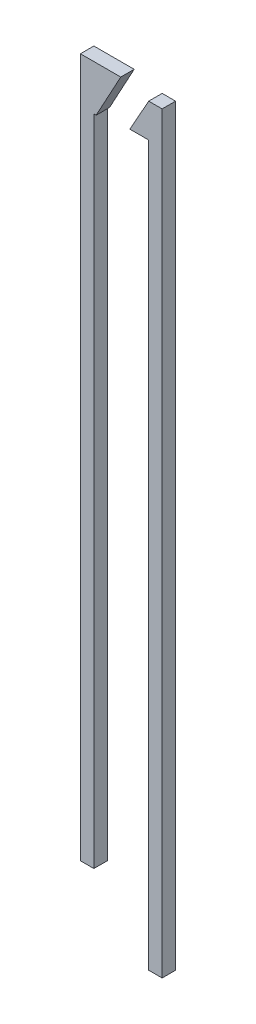
ISO-10303-21;
HEADER;
FILE_DESCRIPTION(('STEP AP214'),'2;1');
FILE_NAME('part.step','',(''),(''),'','','');
FILE_SCHEMA(('AUTOMOTIVE_DESIGN { 1 0 10303 214 1 1 1 1 }'));
ENDSEC;
DATA;
#1=APPLICATION_CONTEXT('core data for automotive mechanical design processes');
#2=APPLICATION_PROTOCOL_DEFINITION('international standard','automotive_design',2000,#1);
#3=PRODUCT_CONTEXT('',#1,'mechanical');
#4=PRODUCT('Part','Part','',(#3));
#5=PRODUCT_RELATED_PRODUCT_CATEGORY('part','',(#4));
#6=PRODUCT_DEFINITION_FORMATION('','',#4);
#7=PRODUCT_DEFINITION_CONTEXT('part definition',#1,'design');
#8=PRODUCT_DEFINITION('design','',#6,#7);
#9=PRODUCT_DEFINITION_SHAPE('','',#8);
#10=(LENGTH_UNIT() NAMED_UNIT(*) SI_UNIT(.MILLI.,.METRE.));
#11=(NAMED_UNIT(*) PLANE_ANGLE_UNIT() SI_UNIT($,.RADIAN.));
#12=(NAMED_UNIT(*) SI_UNIT($,.STERADIAN.) SOLID_ANGLE_UNIT());
#13=UNCERTAINTY_MEASURE_WITH_UNIT(LENGTH_MEASURE(1.E-05),#10,'distance_accuracy_value','');
#14=(GEOMETRIC_REPRESENTATION_CONTEXT(3) GLOBAL_UNCERTAINTY_ASSIGNED_CONTEXT((#13)) GLOBAL_UNIT_ASSIGNED_CONTEXT((#10,
#11,#12)) REPRESENTATION_CONTEXT('',''));
#15=CARTESIAN_POINT('',(0.,0.,0.));
#16=DIRECTION('',(0.,0.,1.));
#17=DIRECTION('',(1.,0.,0.));
#18=AXIS2_PLACEMENT_3D('',#15,#16,#17);
#19=CARTESIAN_POINT('',(-0.148264138017879,13.0387086582279,0.5));
#20=DIRECTION('',(1.,0.,0.));
#21=DIRECTION('',(0.,1.,0.));
#22=AXIS2_PLACEMENT_3D('',#19,#20,#21);
#23=PLANE('',#22);
#24=DIRECTION('',(0.,-1.,0.));
#25=VECTOR('',#24,1.);
#26=CARTESIAN_POINT('',(-0.148264138017879,13.0387086582279,0.));
#27=LINE('',#26,#25);
#28=CARTESIAN_POINT('',(-0.148264138017879,13.0387086582279,0.));
#29=VERTEX_POINT('',#28);
#30=CARTESIAN_POINT('',(-0.148264138017876,-12.9612913417721,0.));
#31=VERTEX_POINT('',#30);
#32=EDGE_CURVE('E127',#29,#31,#27,.T.);
#33=ORIENTED_EDGE('',*,*,#32,.T.);
#34=DIRECTION('',(0.,0.,-1.));
#35=VECTOR('',#34,1.);
#36=CARTESIAN_POINT('',(-0.148264138017876,-12.9612913417721,0.5));
#37=LINE('',#36,#35);
#38=CARTESIAN_POINT('',(-0.148264138017876,-12.9612913417721,0.5));
#39=VERTEX_POINT('',#38);
#40=EDGE_CURVE('E12',#39,#31,#37,.T.);
#41=ORIENTED_EDGE('',*,*,#40,.F.);
#42=DIRECTION('',(0.,-1.,0.));
#43=VECTOR('',#42,1.);
#44=CARTESIAN_POINT('',(-0.148264138017879,13.0387086582279,0.5));
#45=LINE('',#44,#43);
#46=CARTESIAN_POINT('',(-0.148264138017879,13.0387086582279,0.5));
#47=VERTEX_POINT('',#46);
#48=EDGE_CURVE('E137',#47,#39,#45,.T.);
#49=ORIENTED_EDGE('',*,*,#48,.F.);
#50=DIRECTION('',(0.,0.,-1.));
#51=VECTOR('',#50,1.);
#52=CARTESIAN_POINT('',(-0.148264138017879,13.0387086582279,0.5));
#53=LINE('',#52,#51);
#54=EDGE_CURVE('E123',#47,#29,#53,.T.);
#55=ORIENTED_EDGE('',*,*,#54,.T.);
#56=EDGE_LOOP('',(#33,#41,#49,#55));
#57=FACE_BOUND('',#56,.T.);
#58=ADVANCED_FACE('F43',(#57),#23,.F.);
#59=CARTESIAN_POINT('',(-0.148264138017876,-12.9612913417721,0.5));
#60=DIRECTION('',(0.,1.,0.));
#61=DIRECTION('',(0.,0.,1.));
#62=AXIS2_PLACEMENT_3D('',#59,#60,#61);
#63=PLANE('',#62);
#64=DIRECTION('',(1.,0.,0.));
#65=VECTOR('',#64,1.);
#66=CARTESIAN_POINT('',(-0.148264138017876,-12.9612913417721,0.));
#67=LINE('',#66,#65);
#68=CARTESIAN_POINT('',(0.351735861982124,-12.9612913417721,0.));
#69=VERTEX_POINT('',#68);
#70=EDGE_CURVE('E130',#31,#69,#67,.T.);
#71=ORIENTED_EDGE('',*,*,#70,.T.);
#72=DIRECTION('',(0.,0.,-1.));
#73=VECTOR('',#72,1.);
#74=CARTESIAN_POINT('',(0.351735861982124,-12.9612913417721,0.5));
#75=LINE('',#74,#73);
#76=CARTESIAN_POINT('',(0.351735861982124,-12.9612913417721,0.5));
#77=VERTEX_POINT('',#76);
#78=EDGE_CURVE('E51',#77,#69,#75,.T.);
#79=ORIENTED_EDGE('',*,*,#78,.F.);
#80=DIRECTION('',(1.,0.,0.));
#81=VECTOR('',#80,1.);
#82=CARTESIAN_POINT('',(-0.148264138017876,-12.9612913417721,0.5));
#83=LINE('',#82,#81);
#84=EDGE_CURVE('E96',#39,#77,#83,.T.);
#85=ORIENTED_EDGE('',*,*,#84,.F.);
#86=ORIENTED_EDGE('',*,*,#40,.T.);
#87=EDGE_LOOP('',(#71,#79,#85,#86));
#88=FACE_BOUND('',#87,.T.);
#89=ADVANCED_FACE('F161',(#88),#63,.F.);
#90=CARTESIAN_POINT('',(0.351735861982124,-12.9612913417721,0.5));
#91=DIRECTION('',(-1.,0.,0.));
#92=DIRECTION('',(0.,0.,1.));
#93=AXIS2_PLACEMENT_3D('',#90,#91,#92);
#94=PLANE('',#93);
#95=DIRECTION('',(0.,1.,0.));
#96=VECTOR('',#95,1.);
#97=CARTESIAN_POINT('',(0.351735861982124,-12.9612913417721,0.));
#98=LINE('',#97,#96);
#99=CARTESIAN_POINT('',(0.351735861982124,11.35,0.));
#100=VERTEX_POINT('',#99);
#101=EDGE_CURVE('E132',#69,#100,#98,.T.);
#102=ORIENTED_EDGE('',*,*,#101,.T.);
#103=DIRECTION('',(0.,0.,-1.));
#104=VECTOR('',#103,1.);
#105=CARTESIAN_POINT('',(0.351735861982124,11.35,0.5));
#106=LINE('',#105,#104);
#107=CARTESIAN_POINT('',(0.351735861982124,11.35,0.5));
#108=VERTEX_POINT('',#107);
#109=EDGE_CURVE('E118',#108,#100,#106,.T.);
#110=ORIENTED_EDGE('',*,*,#109,.F.);
#111=DIRECTION('',(0.,1.,0.));
#112=VECTOR('',#111,1.);
#113=CARTESIAN_POINT('',(0.351735861982124,-12.9612913417721,0.5));
#114=LINE('',#113,#112);
#115=EDGE_CURVE('E109',#77,#108,#114,.T.);
#116=ORIENTED_EDGE('',*,*,#115,.F.);
#117=ORIENTED_EDGE('',*,*,#78,.T.);
#118=EDGE_LOOP('',(#102,#110,#116,#117));
#119=FACE_BOUND('',#118,.T.);
#120=ADVANCED_FACE('F143',(#119),#94,.F.);
#121=CARTESIAN_POINT('',(0.351735861982124,11.35,0.5));
#122=DIRECTION('',(0.,1.,0.));
#123=DIRECTION('',(0.,0.,1.));
#124=AXIS2_PLACEMENT_3D('',#121,#122,#123);
#125=PLANE('',#124);
#126=DIRECTION('',(1.,0.,0.));
#127=VECTOR('',#126,1.);
#128=CARTESIAN_POINT('',(0.351735861982124,11.35,0.));
#129=LINE('',#128,#127);
#130=CARTESIAN_POINT('',(0.435111642100058,11.35,0.));
#131=VERTEX_POINT('',#130);
#132=EDGE_CURVE('E117',#100,#131,#129,.T.);
#133=ORIENTED_EDGE('',*,*,#132,.T.);
#134=DIRECTION('',(0.,0.,-1.));
#135=VECTOR('',#134,1.);
#136=CARTESIAN_POINT('',(0.435111642100058,11.35,0.5));
#137=LINE('',#136,#135);
#138=CARTESIAN_POINT('',(0.435111642100058,11.35,0.5));
#139=VERTEX_POINT('',#138);
#140=EDGE_CURVE('E114',#139,#131,#137,.T.);
#141=ORIENTED_EDGE('',*,*,#140,.F.);
#142=DIRECTION('',(1.,0.,0.));
#143=VECTOR('',#142,1.);
#144=CARTESIAN_POINT('',(0.351735861982124,11.35,0.5));
#145=LINE('',#144,#143);
#146=EDGE_CURVE('E103',#108,#139,#145,.T.);
#147=ORIENTED_EDGE('',*,*,#146,.F.);
#148=ORIENTED_EDGE('',*,*,#109,.T.);
#149=EDGE_LOOP('',(#133,#141,#147,#148));
#150=FACE_BOUND('',#149,.T.);
#151=ADVANCED_FACE('F115',(#150),#125,.F.);
#152=CARTESIAN_POINT('',(0.435111642100058,11.35,0.5));
#153=DIRECTION('',(-0.878875980813122,0.477050322659751,0.));
#154=DIRECTION('',(-0.477050322659751,-0.878875980813122,0.));
#155=AXIS2_PLACEMENT_3D('',#152,#153,#154);
#156=PLANE('',#155);
#157=DIRECTION('',(0.477050322659751,0.878875980813122,0.));
#158=VECTOR('',#157,1.);
#159=CARTESIAN_POINT('',(0.435111642100058,11.35,0.));
#160=LINE('',#159,#158);
#161=CARTESIAN_POINT('',(1.35173586198212,13.0387086582279,0.));
#162=VERTEX_POINT('',#161);
#163=EDGE_CURVE('E82',#131,#162,#160,.T.);
#164=ORIENTED_EDGE('',*,*,#163,.T.);
#165=DIRECTION('',(0.,0.,-1.));
#166=VECTOR('',#165,1.);
#167=CARTESIAN_POINT('',(1.35173586198212,13.0387086582279,0.5));
#168=LINE('',#167,#166);
#169=CARTESIAN_POINT('',(1.35173586198212,13.0387086582279,0.5));
#170=VERTEX_POINT('',#169);
#171=EDGE_CURVE('E119',#170,#162,#168,.T.);
#172=ORIENTED_EDGE('',*,*,#171,.F.);
#173=DIRECTION('',(0.477050322659751,0.878875980813122,0.));
#174=VECTOR('',#173,1.);
#175=CARTESIAN_POINT('',(0.435111642100058,11.35,0.5));
#176=LINE('',#175,#174);
#177=EDGE_CURVE('E107',#139,#170,#176,.T.);
#178=ORIENTED_EDGE('',*,*,#177,.F.);
#179=ORIENTED_EDGE('',*,*,#140,.T.);
#180=EDGE_LOOP('',(#164,#172,#178,#179));
#181=FACE_BOUND('',#180,.T.);
#182=ADVANCED_FACE('F121',(#181),#156,.F.);
#183=CARTESIAN_POINT('',(-0.148264138017879,13.0387086582279,0.5));
#184=DIRECTION('',(0.,-1.,0.));
#185=DIRECTION('',(0.,0.,-1.));
#186=AXIS2_PLACEMENT_3D('',#183,#184,#185);
#187=PLANE('',#186);
#188=DIRECTION('',(-1.,0.,0.));
#189=VECTOR('',#188,1.);
#190=CARTESIAN_POINT('',(-0.148264138017879,13.0387086582279,0.));
#191=LINE('',#190,#189);
#192=EDGE_CURVE('E88',#162,#29,#191,.T.);
#193=ORIENTED_EDGE('',*,*,#192,.T.);
#194=ORIENTED_EDGE('',*,*,#54,.F.);
#195=DIRECTION('',(-1.,0.,0.));
#196=VECTOR('',#195,1.);
#197=CARTESIAN_POINT('',(-0.148264138017879,13.0387086582279,0.5));
#198=LINE('',#197,#196);
#199=EDGE_CURVE('E59',#170,#47,#198,.T.);
#200=ORIENTED_EDGE('',*,*,#199,.F.);
#201=ORIENTED_EDGE('',*,*,#171,.T.);
#202=EDGE_LOOP('',(#193,#194,#200,#201));
#203=FACE_BOUND('',#202,.T.);
#204=ADVANCED_FACE('F150',(#203),#187,.F.);
#205=CARTESIAN_POINT('',(0.,0.,0.5));
#206=DIRECTION('',(0.,0.,1.));
#207=DIRECTION('',(1.,0.,0.));
#208=AXIS2_PLACEMENT_3D('',#205,#206,#207);
#209=PLANE('',#208);
#210=ORIENTED_EDGE('',*,*,#48,.T.);
#211=ORIENTED_EDGE('',*,*,#84,.T.);
#212=ORIENTED_EDGE('',*,*,#115,.T.);
#213=ORIENTED_EDGE('',*,*,#146,.T.);
#214=ORIENTED_EDGE('',*,*,#177,.T.);
#215=ORIENTED_EDGE('',*,*,#199,.T.);
#216=EDGE_LOOP('',(#210,#211,#212,#213,#214,#215));
#217=FACE_BOUND('',#216,.T.);
#218=ADVANCED_FACE('F105',(#217),#209,.T.);
#219=CARTESIAN_POINT('',(0.,0.,0.));
#220=DIRECTION('',(0.,0.,1.));
#221=DIRECTION('',(1.,0.,0.));
#222=AXIS2_PLACEMENT_3D('',#219,#220,#221);
#223=PLANE('',#222);
#224=ORIENTED_EDGE('',*,*,#32,.F.);
#225=ORIENTED_EDGE('',*,*,#192,.F.);
#226=ORIENTED_EDGE('',*,*,#163,.F.);
#227=ORIENTED_EDGE('',*,*,#132,.F.);
#228=ORIENTED_EDGE('',*,*,#101,.F.);
#229=ORIENTED_EDGE('',*,*,#70,.F.);
#230=EDGE_LOOP('',(#224,#225,#226,#227,#228,#229));
#231=FACE_BOUND('',#230,.T.);
#232=ADVANCED_FACE('F146',(#231),#223,.F.);
#233=CLOSED_SHELL('',(#58,#89,#120,#151,#182,#204,#218,#232));
#234=MANIFOLD_SOLID_BREP('B2',#233);
#235=CARTESIAN_POINT('',(1.69173586198212,11.5287642286895,0.5));
#236=DIRECTION('',(0.873136036814158,-0.487476626328346,0.));
#237=DIRECTION('',(0.487476626328346,0.873136036814158,0.));
#238=AXIS2_PLACEMENT_3D('',#235,#236,#237);
#239=PLANE('',#238);
#240=DIRECTION('',(-0.487476626328346,-0.873136036814158,0.));
#241=VECTOR('',#240,1.);
#242=CARTESIAN_POINT('',(1.69173586198212,11.5287642286895,0.));
#243=LINE('',#242,#241);
#244=CARTESIAN_POINT('',(2.39173586198212,12.7825581395349,0.));
#245=VERTEX_POINT('',#244);
#246=CARTESIAN_POINT('',(1.69173586198212,11.5287642286895,0.));
#247=VERTEX_POINT('',#246);
#248=EDGE_CURVE('E303',#245,#247,#243,.T.);
#249=ORIENTED_EDGE('',*,*,#248,.T.);
#250=DIRECTION('',(0.,0.,-1.));
#251=VECTOR('',#250,1.);
#252=CARTESIAN_POINT('',(1.69173586198212,11.5287642286895,0.5));
#253=LINE('',#252,#251);
#254=CARTESIAN_POINT('',(1.69173586198212,11.5287642286895,0.5));
#255=VERTEX_POINT('',#254);
#256=EDGE_CURVE('E41',#255,#247,#253,.T.);
#257=ORIENTED_EDGE('',*,*,#256,.F.);
#258=DIRECTION('',(-0.487476626328346,-0.873136036814158,0.));
#259=VECTOR('',#258,1.);
#260=CARTESIAN_POINT('',(1.69173586198212,11.5287642286895,0.5));
#261=LINE('',#260,#259);
#262=CARTESIAN_POINT('',(2.39173586198212,12.7825581395349,0.5));
#263=VERTEX_POINT('',#262);
#264=EDGE_CURVE('E313',#263,#255,#261,.T.);
#265=ORIENTED_EDGE('',*,*,#264,.F.);
#266=DIRECTION('',(0.,0.,-1.));
#267=VECTOR('',#266,1.);
#268=CARTESIAN_POINT('',(2.39173586198212,12.7825581395349,0.5));
#269=LINE('',#268,#267);
#270=EDGE_CURVE('E299',#263,#245,#269,.T.);
#271=ORIENTED_EDGE('',*,*,#270,.T.);
#272=EDGE_LOOP('',(#249,#257,#265,#271));
#273=FACE_BOUND('',#272,.T.);
#274=ADVANCED_FACE('F219',(#273),#239,.F.);
#275=CARTESIAN_POINT('',(2.39173586198212,11.5287642286895,0.5));
#276=DIRECTION('',(0.,1.,0.));
#277=DIRECTION('',(-1.,0.,0.));
#278=AXIS2_PLACEMENT_3D('',#275,#276,#277);
#279=PLANE('',#278);
#280=DIRECTION('',(1.,0.,0.));
#281=VECTOR('',#280,1.);
#282=CARTESIAN_POINT('',(2.39173586198212,11.5287642286895,0.));
#283=LINE('',#282,#281);
#284=CARTESIAN_POINT('',(2.39173586198212,11.5287642286895,0.));
#285=VERTEX_POINT('',#284);
#286=EDGE_CURVE('E306',#247,#285,#283,.T.);
#287=ORIENTED_EDGE('',*,*,#286,.T.);
#288=DIRECTION('',(0.,0.,-1.));
#289=VECTOR('',#288,1.);
#290=CARTESIAN_POINT('',(2.39173586198212,11.5287642286895,0.5));
#291=LINE('',#290,#289);
#292=CARTESIAN_POINT('',(2.39173586198212,11.5287642286895,0.5));
#293=VERTEX_POINT('',#292);
#294=EDGE_CURVE('E227',#293,#285,#291,.T.);
#295=ORIENTED_EDGE('',*,*,#294,.F.);
#296=DIRECTION('',(1.,0.,0.));
#297=VECTOR('',#296,1.);
#298=CARTESIAN_POINT('',(2.39173586198212,11.5287642286895,0.5));
#299=LINE('',#298,#297);
#300=EDGE_CURVE('E272',#255,#293,#299,.T.);
#301=ORIENTED_EDGE('',*,*,#300,.F.);
#302=ORIENTED_EDGE('',*,*,#256,.T.);
#303=EDGE_LOOP('',(#287,#295,#301,#302));
#304=FACE_BOUND('',#303,.T.);
#305=ADVANCED_FACE('F337',(#304),#279,.F.);
#306=CARTESIAN_POINT('',(2.39173586198212,-15.2174418604651,0.5));
#307=DIRECTION('',(1.,0.,0.));
#308=DIRECTION('',(0.,0.,-1.));
#309=AXIS2_PLACEMENT_3D('',#306,#307,#308);
#310=PLANE('',#309);
#311=DIRECTION('',(0.,-1.,0.));
#312=VECTOR('',#311,1.);
#313=CARTESIAN_POINT('',(2.39173586198212,-15.2174418604651,0.));
#314=LINE('',#313,#312);
#315=CARTESIAN_POINT('',(2.39173586198212,-15.2174418604651,0.));
#316=VERTEX_POINT('',#315);
#317=EDGE_CURVE('E308',#285,#316,#314,.T.);
#318=ORIENTED_EDGE('',*,*,#317,.T.);
#319=DIRECTION('',(0.,0.,-1.));
#320=VECTOR('',#319,1.);
#321=CARTESIAN_POINT('',(2.39173586198212,-15.2174418604651,0.5));
#322=LINE('',#321,#320);
#323=CARTESIAN_POINT('',(2.39173586198212,-15.2174418604651,0.5));
#324=VERTEX_POINT('',#323);
#325=EDGE_CURVE('E294',#324,#316,#322,.T.);
#326=ORIENTED_EDGE('',*,*,#325,.F.);
#327=DIRECTION('',(0.,-1.,0.));
#328=VECTOR('',#327,1.);
#329=CARTESIAN_POINT('',(2.39173586198212,-15.2174418604651,0.5));
#330=LINE('',#329,#328);
#331=EDGE_CURVE('E285',#293,#324,#330,.T.);
#332=ORIENTED_EDGE('',*,*,#331,.F.);
#333=ORIENTED_EDGE('',*,*,#294,.T.);
#334=EDGE_LOOP('',(#318,#326,#332,#333));
#335=FACE_BOUND('',#334,.T.);
#336=ADVANCED_FACE('F319',(#335),#310,.F.);
#337=CARTESIAN_POINT('',(2.89173586198212,-15.2174418604651,0.5));
#338=DIRECTION('',(0.,1.,0.));
#339=DIRECTION('',(0.,0.,1.));
#340=AXIS2_PLACEMENT_3D('',#337,#338,#339);
#341=PLANE('',#340);
#342=DIRECTION('',(1.,0.,0.));
#343=VECTOR('',#342,1.);
#344=CARTESIAN_POINT('',(2.89173586198212,-15.2174418604651,0.));
#345=LINE('',#344,#343);
#346=CARTESIAN_POINT('',(2.89173586198212,-15.2174418604651,0.));
#347=VERTEX_POINT('',#346);
#348=EDGE_CURVE('E293',#316,#347,#345,.T.);
#349=ORIENTED_EDGE('',*,*,#348,.T.);
#350=DIRECTION('',(0.,0.,-1.));
#351=VECTOR('',#350,1.);
#352=CARTESIAN_POINT('',(2.89173586198212,-15.2174418604651,0.5));
#353=LINE('',#352,#351);
#354=CARTESIAN_POINT('',(2.89173586198212,-15.2174418604651,0.5));
#355=VERTEX_POINT('',#354);
#356=EDGE_CURVE('E290',#355,#347,#353,.T.);
#357=ORIENTED_EDGE('',*,*,#356,.F.);
#358=DIRECTION('',(1.,0.,0.));
#359=VECTOR('',#358,1.);
#360=CARTESIAN_POINT('',(2.89173586198212,-15.2174418604651,0.5));
#361=LINE('',#360,#359);
#362=EDGE_CURVE('E279',#324,#355,#361,.T.);
#363=ORIENTED_EDGE('',*,*,#362,.F.);
#364=ORIENTED_EDGE('',*,*,#325,.T.);
#365=EDGE_LOOP('',(#349,#357,#363,#364));
#366=FACE_BOUND('',#365,.T.);
#367=ADVANCED_FACE('F291',(#366),#341,.F.);
#368=CARTESIAN_POINT('',(2.89173586198212,12.7825581395349,0.5));
#369=DIRECTION('',(-1.,0.,0.));
#370=DIRECTION('',(0.,-1.,0.));
#371=AXIS2_PLACEMENT_3D('',#368,#369,#370);
#372=PLANE('',#371);
#373=DIRECTION('',(0.,1.,0.));
#374=VECTOR('',#373,1.);
#375=CARTESIAN_POINT('',(2.89173586198212,12.7825581395349,0.));
#376=LINE('',#375,#374);
#377=CARTESIAN_POINT('',(2.89173586198212,12.7825581395349,0.));
#378=VERTEX_POINT('',#377);
#379=EDGE_CURVE('E258',#347,#378,#376,.T.);
#380=ORIENTED_EDGE('',*,*,#379,.T.);
#381=DIRECTION('',(0.,0.,-1.));
#382=VECTOR('',#381,1.);
#383=CARTESIAN_POINT('',(2.89173586198212,12.7825581395349,0.5));
#384=LINE('',#383,#382);
#385=CARTESIAN_POINT('',(2.89173586198212,12.7825581395349,0.5));
#386=VERTEX_POINT('',#385);
#387=EDGE_CURVE('E295',#386,#378,#384,.T.);
#388=ORIENTED_EDGE('',*,*,#387,.F.);
#389=DIRECTION('',(0.,1.,0.));
#390=VECTOR('',#389,1.);
#391=CARTESIAN_POINT('',(2.89173586198212,12.7825581395349,0.5));
#392=LINE('',#391,#390);
#393=EDGE_CURVE('E283',#355,#386,#392,.T.);
#394=ORIENTED_EDGE('',*,*,#393,.F.);
#395=ORIENTED_EDGE('',*,*,#356,.T.);
#396=EDGE_LOOP('',(#380,#388,#394,#395));
#397=FACE_BOUND('',#396,.T.);
#398=ADVANCED_FACE('F297',(#397),#372,.F.);
#399=CARTESIAN_POINT('',(2.39173586198212,12.7825581395349,0.5));
#400=DIRECTION('',(0.,-1.,0.));
#401=DIRECTION('',(0.,0.,-1.));
#402=AXIS2_PLACEMENT_3D('',#399,#400,#401);
#403=PLANE('',#402);
#404=DIRECTION('',(-1.,0.,0.));
#405=VECTOR('',#404,1.);
#406=CARTESIAN_POINT('',(2.39173586198212,12.7825581395349,0.));
#407=LINE('',#406,#405);
#408=EDGE_CURVE('E264',#378,#245,#407,.T.);
#409=ORIENTED_EDGE('',*,*,#408,.T.);
#410=ORIENTED_EDGE('',*,*,#270,.F.);
#411=DIRECTION('',(-1.,0.,0.));
#412=VECTOR('',#411,1.);
#413=CARTESIAN_POINT('',(2.39173586198212,12.7825581395349,0.5));
#414=LINE('',#413,#412);
#415=EDGE_CURVE('E235',#386,#263,#414,.T.);
#416=ORIENTED_EDGE('',*,*,#415,.F.);
#417=ORIENTED_EDGE('',*,*,#387,.T.);
#418=EDGE_LOOP('',(#409,#410,#416,#417));
#419=FACE_BOUND('',#418,.T.);
#420=ADVANCED_FACE('F326',(#419),#403,.F.);
#421=CARTESIAN_POINT('',(0.,0.,0.5));
#422=DIRECTION('',(0.,0.,-1.));
#423=DIRECTION('',(-1.,0.,0.));
#424=AXIS2_PLACEMENT_3D('',#421,#422,#423);
#425=PLANE('',#424);
#426=ORIENTED_EDGE('',*,*,#264,.T.);
#427=ORIENTED_EDGE('',*,*,#300,.T.);
#428=ORIENTED_EDGE('',*,*,#331,.T.);
#429=ORIENTED_EDGE('',*,*,#362,.T.);
#430=ORIENTED_EDGE('',*,*,#393,.T.);
#431=ORIENTED_EDGE('',*,*,#415,.T.);
#432=EDGE_LOOP('',(#426,#427,#428,#429,#430,#431));
#433=FACE_BOUND('',#432,.T.);
#434=ADVANCED_FACE('F281',(#433),#425,.F.);
#435=CARTESIAN_POINT('',(0.,0.,0.));
#436=DIRECTION('',(0.,0.,-1.));
#437=DIRECTION('',(-1.,0.,0.));
#438=AXIS2_PLACEMENT_3D('',#435,#436,#437);
#439=PLANE('',#438);
#440=ORIENTED_EDGE('',*,*,#248,.F.);
#441=ORIENTED_EDGE('',*,*,#408,.F.);
#442=ORIENTED_EDGE('',*,*,#379,.F.);
#443=ORIENTED_EDGE('',*,*,#348,.F.);
#444=ORIENTED_EDGE('',*,*,#317,.F.);
#445=ORIENTED_EDGE('',*,*,#286,.F.);
#446=EDGE_LOOP('',(#440,#441,#442,#443,#444,#445));
#447=FACE_BOUND('',#446,.T.);
#448=ADVANCED_FACE('F322',(#447),#439,.T.);
#449=CLOSED_SHELL('',(#274,#305,#336,#367,#398,#420,#434,#448));
#450=MANIFOLD_SOLID_BREP('B6',#449);
#451=ADVANCED_BREP_SHAPE_REPRESENTATION('',(#18,#234,#450),#14);
#452=SHAPE_DEFINITION_REPRESENTATION(#9,#451);
ENDSEC;
END-ISO-10303-21;
